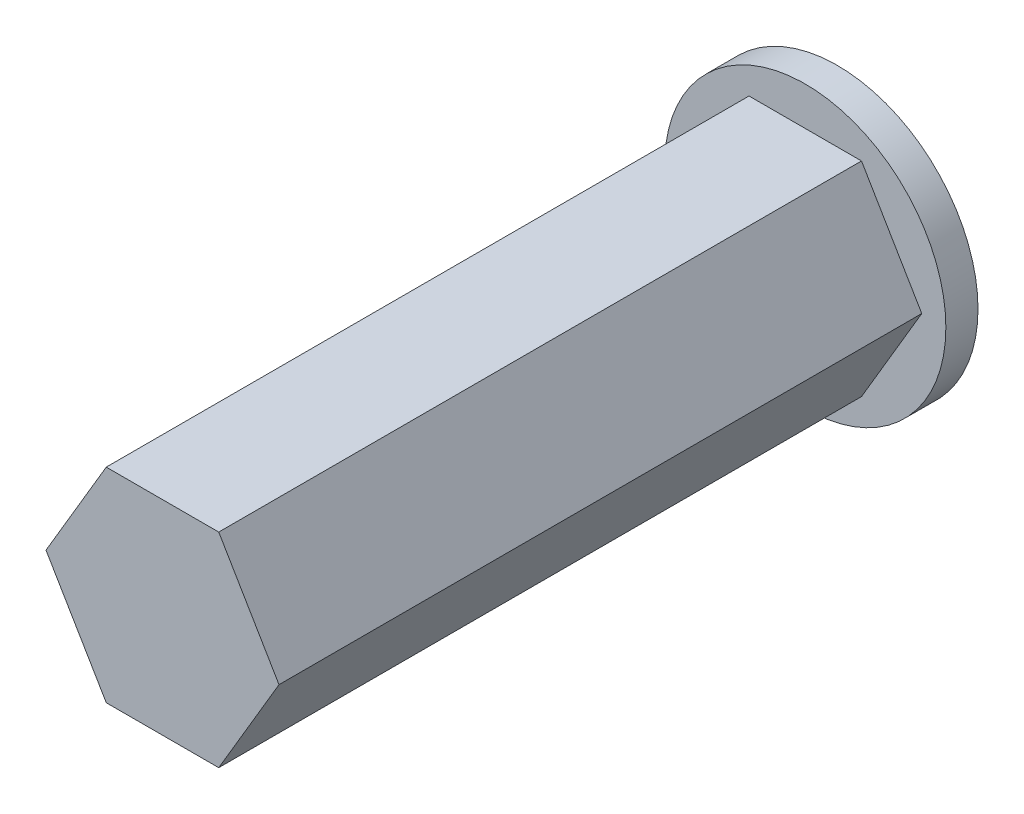
ISO-10303-21;
HEADER;
FILE_DESCRIPTION(('STEP AP214'),'2;1');
FILE_NAME('part.step','',(''),(''),'','','');
FILE_SCHEMA(('AUTOMOTIVE_DESIGN { 1 0 10303 214 1 1 1 1 }'));
ENDSEC;
DATA;
#1=APPLICATION_CONTEXT('core data for automotive mechanical design processes');
#2=APPLICATION_PROTOCOL_DEFINITION('international standard','automotive_design',2000,#1);
#3=PRODUCT_CONTEXT('',#1,'mechanical');
#4=PRODUCT('Part','Part','',(#3));
#5=PRODUCT_RELATED_PRODUCT_CATEGORY('part','',(#4));
#6=PRODUCT_DEFINITION_FORMATION('','',#4);
#7=PRODUCT_DEFINITION_CONTEXT('part definition',#1,'design');
#8=PRODUCT_DEFINITION('design','',#6,#7);
#9=PRODUCT_DEFINITION_SHAPE('','',#8);
#10=(LENGTH_UNIT() NAMED_UNIT(*) SI_UNIT(.MILLI.,.METRE.));
#11=(NAMED_UNIT(*) PLANE_ANGLE_UNIT() SI_UNIT($,.RADIAN.));
#12=(NAMED_UNIT(*) SI_UNIT($,.STERADIAN.) SOLID_ANGLE_UNIT());
#13=UNCERTAINTY_MEASURE_WITH_UNIT(LENGTH_MEASURE(1.E-05),#10,'distance_accuracy_value','');
#14=(GEOMETRIC_REPRESENTATION_CONTEXT(3) GLOBAL_UNCERTAINTY_ASSIGNED_CONTEXT((#13)) GLOBAL_UNIT_ASSIGNED_CONTEXT((#10,
#11,#12)) REPRESENTATION_CONTEXT('',''));
#15=CARTESIAN_POINT('',(0.,0.,0.));
#16=DIRECTION('',(0.,0.,1.));
#17=DIRECTION('',(1.,0.,0.));
#18=AXIS2_PLACEMENT_3D('',#15,#16,#17);
#19=CARTESIAN_POINT('',(0.,0.,2.));
#20=DIRECTION('',(0.,0.,-1.));
#21=DIRECTION('',(-1.,0.,0.));
#22=AXIS2_PLACEMENT_3D('',#19,#20,#21);
#23=CYLINDRICAL_SURFACE('',#22,8.75);
#24=CARTESIAN_POINT('',(0.,0.,2.));
#25=DIRECTION('',(0.,0.,1.));
#26=DIRECTION('',(1.,0.,0.));
#27=AXIS2_PLACEMENT_3D('',#24,#25,#26);
#28=CIRCLE('',#27,8.75);
#29=CARTESIAN_POINT('',(8.75,0.,2.));
#30=VERTEX_POINT('',#29);
#31=EDGE_CURVE('E11',#30,#30,#28,.T.);
#32=ORIENTED_EDGE('',*,*,#31,.F.);
#33=EDGE_LOOP('',(#32));
#34=FACE_BOUND('',#33,.T.);
#35=CARTESIAN_POINT('',(0.,0.,0.));
#36=DIRECTION('',(0.,0.,1.));
#37=DIRECTION('',(1.,0.,0.));
#38=AXIS2_PLACEMENT_3D('',#35,#36,#37);
#39=CIRCLE('',#38,8.75);
#40=CARTESIAN_POINT('',(8.75,0.,0.));
#41=VERTEX_POINT('',#40);
#42=EDGE_CURVE('E42',#41,#41,#39,.T.);
#43=ORIENTED_EDGE('',*,*,#42,.T.);
#44=EDGE_LOOP('',(#43));
#45=FACE_BOUND('',#44,.T.);
#46=ADVANCED_FACE('F39',(#34,#45),#23,.T.);
#47=CARTESIAN_POINT('',(0.,0.,2.));
#48=DIRECTION('',(0.,0.,1.));
#49=DIRECTION('',(1.,0.,0.));
#50=AXIS2_PLACEMENT_3D('',#47,#48,#49);
#51=PLANE('',#50);
#52=DIRECTION('',(0.508500871164439,0.861061475171783,0.));
#53=VECTOR('',#52,1.);
#54=CARTESIAN_POINT('',(3.5,-6.35,2.));
#55=LINE('',#54,#53);
#56=CARTESIAN_POINT('',(3.5,-6.35,2.));
#57=VERTEX_POINT('',#56);
#58=CARTESIAN_POINT('',(7.25,0.,2.));
#59=VERTEX_POINT('',#58);
#60=EDGE_CURVE('E54',#57,#59,#55,.T.);
#61=ORIENTED_EDGE('',*,*,#60,.F.);
#62=DIRECTION('',(1.,0.,0.));
#63=VECTOR('',#62,1.);
#64=CARTESIAN_POINT('',(3.5,-6.35,2.));
#65=LINE('',#64,#63);
#66=CARTESIAN_POINT('',(-3.49999999999999,-6.35,2.));
#67=VERTEX_POINT('',#66);
#68=EDGE_CURVE('E58',#67,#57,#65,.T.);
#69=ORIENTED_EDGE('',*,*,#68,.F.);
#70=DIRECTION('',(0.508500871164439,-0.861061475171782,0.));
#71=VECTOR('',#70,1.);
#72=CARTESIAN_POINT('',(-3.49999999999999,-6.35,2.));
#73=LINE('',#72,#71);
#74=CARTESIAN_POINT('',(-7.25,0.,2.));
#75=VERTEX_POINT('',#74);
#76=EDGE_CURVE('E138',#75,#67,#73,.T.);
#77=ORIENTED_EDGE('',*,*,#76,.F.);
#78=DIRECTION('',(-0.508500871164439,-0.861061475171783,0.));
#79=VECTOR('',#78,1.);
#80=CARTESIAN_POINT('',(-3.5,6.35,2.));
#81=LINE('',#80,#79);
#82=CARTESIAN_POINT('',(-3.5,6.35,2.));
#83=VERTEX_POINT('',#82);
#84=EDGE_CURVE('E141',#83,#75,#81,.T.);
#85=ORIENTED_EDGE('',*,*,#84,.F.);
#86=DIRECTION('',(-1.,0.,0.));
#87=VECTOR('',#86,1.);
#88=CARTESIAN_POINT('',(3.5,6.35,2.));
#89=LINE('',#88,#87);
#90=CARTESIAN_POINT('',(3.5,6.35,2.));
#91=VERTEX_POINT('',#90);
#92=EDGE_CURVE('E145',#91,#83,#89,.T.);
#93=ORIENTED_EDGE('',*,*,#92,.F.);
#94=DIRECTION('',(-0.508500871164439,0.861061475171783,0.));
#95=VECTOR('',#94,1.);
#96=CARTESIAN_POINT('',(3.5,6.35,2.));
#97=LINE('',#96,#95);
#98=EDGE_CURVE('E149',#59,#91,#97,.T.);
#99=ORIENTED_EDGE('',*,*,#98,.F.);
#100=EDGE_LOOP('',(#61,#69,#77,#85,#93,#99));
#101=FACE_BOUND('',#100,.T.);
#102=ORIENTED_EDGE('',*,*,#31,.T.);
#103=EDGE_LOOP('',(#102));
#104=FACE_BOUND('',#103,.T.);
#105=ADVANCED_FACE('F185',(#101,#104),#51,.T.);
#106=CARTESIAN_POINT('',(0.,0.,0.));
#107=DIRECTION('',(0.,0.,1.));
#108=DIRECTION('',(1.,0.,0.));
#109=AXIS2_PLACEMENT_3D('',#106,#107,#108);
#110=PLANE('',#109);
#111=ORIENTED_EDGE('',*,*,#42,.F.);
#112=EDGE_LOOP('',(#111));
#113=FACE_BOUND('',#112,.T.);
#114=ADVANCED_FACE('F190',(#113),#110,.F.);
#115=CARTESIAN_POINT('',(3.5,-6.35,42.));
#116=DIRECTION('',(-0.861061475171783,0.508500871164439,0.));
#117=DIRECTION('',(-0.508500871164439,-0.861061475171783,0.));
#118=AXIS2_PLACEMENT_3D('',#115,#116,#117);
#119=PLANE('',#118);
#120=ORIENTED_EDGE('',*,*,#60,.T.);
#121=DIRECTION('',(0.,0.,-1.));
#122=VECTOR('',#121,1.);
#123=CARTESIAN_POINT('',(7.25,0.,42.));
#124=LINE('',#123,#122);
#125=CARTESIAN_POINT('',(7.25,0.,42.));
#126=VERTEX_POINT('',#125);
#127=EDGE_CURVE('E95',#126,#59,#124,.T.);
#128=ORIENTED_EDGE('',*,*,#127,.F.);
#129=DIRECTION('',(0.508500871164439,0.861061475171783,0.));
#130=VECTOR('',#129,1.);
#131=CARTESIAN_POINT('',(3.5,-6.35,42.));
#132=LINE('',#131,#130);
#133=CARTESIAN_POINT('',(3.5,-6.35,42.));
#134=VERTEX_POINT('',#133);
#135=EDGE_CURVE('E102',#134,#126,#132,.T.);
#136=ORIENTED_EDGE('',*,*,#135,.F.);
#137=DIRECTION('',(0.,0.,-1.));
#138=VECTOR('',#137,1.);
#139=CARTESIAN_POINT('',(3.5,-6.35,42.));
#140=LINE('',#139,#138);
#141=EDGE_CURVE('E133',#134,#57,#140,.T.);
#142=ORIENTED_EDGE('',*,*,#141,.T.);
#143=EDGE_LOOP('',(#120,#128,#136,#142));
#144=FACE_BOUND('',#143,.T.);
#145=ADVANCED_FACE('F113',(#144),#119,.F.);
#146=CARTESIAN_POINT('',(3.5,6.35,42.));
#147=DIRECTION('',(-0.861061475171783,-0.508500871164439,0.));
#148=DIRECTION('',(0.508500871164439,-0.861061475171783,0.));
#149=AXIS2_PLACEMENT_3D('',#146,#147,#148);
#150=PLANE('',#149);
#151=ORIENTED_EDGE('',*,*,#98,.T.);
#152=DIRECTION('',(0.,0.,-1.));
#153=VECTOR('',#152,1.);
#154=CARTESIAN_POINT('',(3.5,6.35,42.));
#155=LINE('',#154,#153);
#156=CARTESIAN_POINT('',(3.5,6.35,42.));
#157=VERTEX_POINT('',#156);
#158=EDGE_CURVE('E97',#157,#91,#155,.T.);
#159=ORIENTED_EDGE('',*,*,#158,.F.);
#160=DIRECTION('',(-0.508500871164439,0.861061475171783,0.));
#161=VECTOR('',#160,1.);
#162=CARTESIAN_POINT('',(3.5,6.35,42.));
#163=LINE('',#162,#161);
#164=EDGE_CURVE('E90',#126,#157,#163,.T.);
#165=ORIENTED_EDGE('',*,*,#164,.F.);
#166=ORIENTED_EDGE('',*,*,#127,.T.);
#167=EDGE_LOOP('',(#151,#159,#165,#166));
#168=FACE_BOUND('',#167,.T.);
#169=ADVANCED_FACE('F93',(#168),#150,.F.);
#170=CARTESIAN_POINT('',(3.5,6.35,42.));
#171=DIRECTION('',(0.,-1.,0.));
#172=DIRECTION('',(0.,0.,-1.));
#173=AXIS2_PLACEMENT_3D('',#170,#171,#172);
#174=PLANE('',#173);
#175=ORIENTED_EDGE('',*,*,#92,.T.);
#176=DIRECTION('',(0.,0.,-1.));
#177=VECTOR('',#176,1.);
#178=CARTESIAN_POINT('',(-3.5,6.35,42.));
#179=LINE('',#178,#177);
#180=CARTESIAN_POINT('',(-3.5,6.35,42.));
#181=VERTEX_POINT('',#180);
#182=EDGE_CURVE('E119',#181,#83,#179,.T.);
#183=ORIENTED_EDGE('',*,*,#182,.F.);
#184=DIRECTION('',(-1.,0.,0.));
#185=VECTOR('',#184,1.);
#186=CARTESIAN_POINT('',(3.5,6.35,42.));
#187=LINE('',#186,#185);
#188=EDGE_CURVE('E101',#157,#181,#187,.T.);
#189=ORIENTED_EDGE('',*,*,#188,.F.);
#190=ORIENTED_EDGE('',*,*,#158,.T.);
#191=EDGE_LOOP('',(#175,#183,#189,#190));
#192=FACE_BOUND('',#191,.T.);
#193=ADVANCED_FACE('F167',(#192),#174,.F.);
#194=CARTESIAN_POINT('',(-3.5,6.35,42.));
#195=DIRECTION('',(0.861061475171783,-0.508500871164439,0.));
#196=DIRECTION('',(0.508500871164439,0.861061475171783,0.));
#197=AXIS2_PLACEMENT_3D('',#194,#195,#196);
#198=PLANE('',#197);
#199=ORIENTED_EDGE('',*,*,#84,.T.);
#200=DIRECTION('',(0.,0.,-1.));
#201=VECTOR('',#200,1.);
#202=CARTESIAN_POINT('',(-7.25,0.,42.));
#203=LINE('',#202,#201);
#204=CARTESIAN_POINT('',(-7.25,0.,42.));
#205=VERTEX_POINT('',#204);
#206=EDGE_CURVE('E125',#205,#75,#203,.T.);
#207=ORIENTED_EDGE('',*,*,#206,.F.);
#208=DIRECTION('',(-0.508500871164439,-0.861061475171783,0.));
#209=VECTOR('',#208,1.);
#210=CARTESIAN_POINT('',(-3.5,6.35,42.));
#211=LINE('',#210,#209);
#212=EDGE_CURVE('E159',#181,#205,#211,.T.);
#213=ORIENTED_EDGE('',*,*,#212,.F.);
#214=ORIENTED_EDGE('',*,*,#182,.T.);
#215=EDGE_LOOP('',(#199,#207,#213,#214));
#216=FACE_BOUND('',#215,.T.);
#217=ADVANCED_FACE('F169',(#216),#198,.F.);
#218=CARTESIAN_POINT('',(-3.49999999999999,-6.35,42.));
#219=DIRECTION('',(0.861061475171782,0.508500871164439,0.));
#220=DIRECTION('',(-0.508500871164439,0.861061475171782,0.));
#221=AXIS2_PLACEMENT_3D('',#218,#219,#220);
#222=PLANE('',#221);
#223=ORIENTED_EDGE('',*,*,#76,.T.);
#224=DIRECTION('',(0.,0.,-1.));
#225=VECTOR('',#224,1.);
#226=CARTESIAN_POINT('',(-3.49999999999999,-6.35,42.));
#227=LINE('',#226,#225);
#228=CARTESIAN_POINT('',(-3.49999999999999,-6.35,42.));
#229=VERTEX_POINT('',#228);
#230=EDGE_CURVE('E129',#229,#67,#227,.T.);
#231=ORIENTED_EDGE('',*,*,#230,.F.);
#232=DIRECTION('',(0.508500871164439,-0.861061475171782,0.));
#233=VECTOR('',#232,1.);
#234=CARTESIAN_POINT('',(-3.49999999999999,-6.35,42.));
#235=LINE('',#234,#233);
#236=EDGE_CURVE('E156',#205,#229,#235,.T.);
#237=ORIENTED_EDGE('',*,*,#236,.F.);
#238=ORIENTED_EDGE('',*,*,#206,.T.);
#239=EDGE_LOOP('',(#223,#231,#237,#238));
#240=FACE_BOUND('',#239,.T.);
#241=ADVANCED_FACE('F173',(#240),#222,.F.);
#242=CARTESIAN_POINT('',(3.5,-6.35,42.));
#243=DIRECTION('',(0.,1.,0.));
#244=DIRECTION('',(0.,0.,1.));
#245=AXIS2_PLACEMENT_3D('',#242,#243,#244);
#246=PLANE('',#245);
#247=ORIENTED_EDGE('',*,*,#68,.T.);
#248=ORIENTED_EDGE('',*,*,#141,.F.);
#249=DIRECTION('',(1.,0.,0.));
#250=VECTOR('',#249,1.);
#251=CARTESIAN_POINT('',(3.5,-6.35,42.));
#252=LINE('',#251,#250);
#253=EDGE_CURVE('E107',#229,#134,#252,.T.);
#254=ORIENTED_EDGE('',*,*,#253,.F.);
#255=ORIENTED_EDGE('',*,*,#230,.T.);
#256=EDGE_LOOP('',(#247,#248,#254,#255));
#257=FACE_BOUND('',#256,.T.);
#258=ADVANCED_FACE('F175',(#257),#246,.F.);
#259=CARTESIAN_POINT('',(0.,0.,42.));
#260=DIRECTION('',(0.,0.,-1.));
#261=DIRECTION('',(-1.,0.,0.));
#262=AXIS2_PLACEMENT_3D('',#259,#260,#261);
#263=PLANE('',#262);
#264=ORIENTED_EDGE('',*,*,#135,.T.);
#265=ORIENTED_EDGE('',*,*,#164,.T.);
#266=ORIENTED_EDGE('',*,*,#188,.T.);
#267=ORIENTED_EDGE('',*,*,#212,.T.);
#268=ORIENTED_EDGE('',*,*,#236,.T.);
#269=ORIENTED_EDGE('',*,*,#253,.T.);
#270=EDGE_LOOP('',(#264,#265,#266,#267,#268,#269));
#271=FACE_BOUND('',#270,.T.);
#272=ADVANCED_FACE('F105',(#271),#263,.F.);
#273=CLOSED_SHELL('',(#46,#105,#114,#145,#169,#193,#217,#241,#258,#272));
#274=MANIFOLD_SOLID_BREP('B2',#273);
#275=ADVANCED_BREP_SHAPE_REPRESENTATION('',(#18,#274),#14);
#276=SHAPE_DEFINITION_REPRESENTATION(#9,#275);
ENDSEC;
END-ISO-10303-21;
